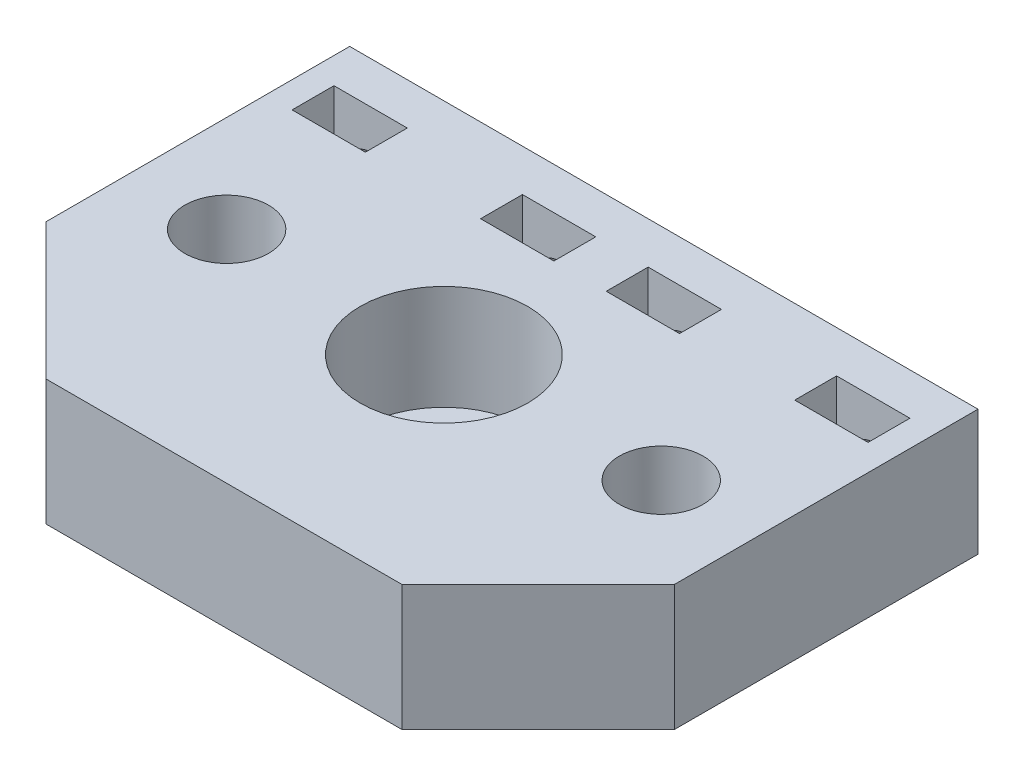
ISO-10303-21;
HEADER;
FILE_DESCRIPTION(('STEP AP214'),'2;1');
FILE_NAME('part.step','',(''),(''),'','','');
FILE_SCHEMA(('AUTOMOTIVE_DESIGN { 1 0 10303 214 1 1 1 1 }'));
ENDSEC;
DATA;
#1=APPLICATION_CONTEXT('core data for automotive mechanical design processes');
#2=APPLICATION_PROTOCOL_DEFINITION('international standard','automotive_design',2000,#1);
#3=PRODUCT_CONTEXT('',#1,'mechanical');
#4=PRODUCT('Part','Part','',(#3));
#5=PRODUCT_RELATED_PRODUCT_CATEGORY('part','',(#4));
#6=PRODUCT_DEFINITION_FORMATION('','',#4);
#7=PRODUCT_DEFINITION_CONTEXT('part definition',#1,'design');
#8=PRODUCT_DEFINITION('design','',#6,#7);
#9=PRODUCT_DEFINITION_SHAPE('','',#8);
#10=(LENGTH_UNIT() NAMED_UNIT(*) SI_UNIT(.MILLI.,.METRE.));
#11=(NAMED_UNIT(*) PLANE_ANGLE_UNIT() SI_UNIT($,.RADIAN.));
#12=(NAMED_UNIT(*) SI_UNIT($,.STERADIAN.) SOLID_ANGLE_UNIT());
#13=UNCERTAINTY_MEASURE_WITH_UNIT(LENGTH_MEASURE(1.E-05),#10,'distance_accuracy_value','');
#14=(GEOMETRIC_REPRESENTATION_CONTEXT(3) GLOBAL_UNCERTAINTY_ASSIGNED_CONTEXT((#13)) GLOBAL_UNIT_ASSIGNED_CONTEXT((#10,
#11,#12)) REPRESENTATION_CONTEXT('',''));
#15=CARTESIAN_POINT('',(0.,0.,0.));
#16=DIRECTION('',(0.,0.,1.));
#17=DIRECTION('',(1.,0.,0.));
#18=AXIS2_PLACEMENT_3D('',#15,#16,#17);
#19=CARTESIAN_POINT('',(0.,12.,0.));
#20=DIRECTION('',(0.,-1.,0.));
#21=DIRECTION('',(0.,0.,-1.));
#22=AXIS2_PLACEMENT_3D('',#19,#20,#21);
#23=PLANE('',#22);
#24=DIRECTION('',(1.,0.,0.));
#25=VECTOR('',#24,1.);
#26=CARTESIAN_POINT('',(0.,12.,-12.9999999999999));
#27=LINE('',#26,#25);
#28=CARTESIAN_POINT('',(2.49999999999995,12.,-12.9999999999999));
#29=VERTEX_POINT('',#28);
#30=CARTESIAN_POINT('',(9.49999999999995,12.,-12.9999999999999));
#31=VERTEX_POINT('',#30);
#32=EDGE_CURVE('E304',#29,#31,#27,.T.);
#33=ORIENTED_EDGE('',*,*,#32,.F.);
#34=DIRECTION('',(0.,0.,1.));
#35=VECTOR('',#34,1.);
#36=CARTESIAN_POINT('',(2.49999999999996,12.,0.));
#37=LINE('',#36,#35);
#38=CARTESIAN_POINT('',(2.49999999999994,12.,-17.));
#39=VERTEX_POINT('',#38);
#40=EDGE_CURVE('E298',#39,#29,#37,.T.);
#41=ORIENTED_EDGE('',*,*,#40,.F.);
#42=DIRECTION('',(-1.,0.,0.));
#43=VECTOR('',#42,1.);
#44=CARTESIAN_POINT('',(2.94902990916058E-13,12.,-17.));
#45=LINE('',#44,#43);
#46=CARTESIAN_POINT('',(9.49999999999994,12.,-16.9999999999999));
#47=VERTEX_POINT('',#46);
#48=EDGE_CURVE('E300',#47,#39,#45,.T.);
#49=ORIENTED_EDGE('',*,*,#48,.F.);
#50=DIRECTION('',(0.,0.,-1.));
#51=VECTOR('',#50,1.);
#52=CARTESIAN_POINT('',(9.49999999999997,12.,0.));
#53=LINE('',#52,#51);
#54=EDGE_CURVE('E302',#31,#47,#53,.T.);
#55=ORIENTED_EDGE('',*,*,#54,.F.);
#56=EDGE_LOOP('',(#33,#41,#49,#55));
#57=FACE_BOUND('',#56,.T.);
#58=DIRECTION('',(0.,0.,1.));
#59=VECTOR('',#58,1.);
#60=CARTESIAN_POINT('',(-27.5,12.,0.));
#61=LINE('',#60,#59);
#62=CARTESIAN_POINT('',(-27.4999999999999,12.,-17.));
#63=VERTEX_POINT('',#62);
#64=CARTESIAN_POINT('',(-27.4999999999999,12.,-13.));
#65=VERTEX_POINT('',#64);
#66=EDGE_CURVE('E287',#63,#65,#61,.T.);
#67=ORIENTED_EDGE('',*,*,#66,.F.);
#68=DIRECTION('',(-1.,0.,0.));
#69=VECTOR('',#68,1.);
#70=CARTESIAN_POINT('',(-3.03328790656524E-13,12.,-17.0000000000005));
#71=LINE('',#70,#69);
#72=CARTESIAN_POINT('',(-20.4999999999999,12.,-17.0000000000001));
#73=VERTEX_POINT('',#72);
#74=EDGE_CURVE('E196',#73,#63,#71,.T.);
#75=ORIENTED_EDGE('',*,*,#74,.F.);
#76=DIRECTION('',(0.,0.,-1.));
#77=VECTOR('',#76,1.);
#78=CARTESIAN_POINT('',(-20.5,12.,0.));
#79=LINE('',#78,#77);
#80=CARTESIAN_POINT('',(-20.4999999999999,12.,-13.));
#81=VERTEX_POINT('',#80);
#82=EDGE_CURVE('E282',#81,#73,#79,.T.);
#83=ORIENTED_EDGE('',*,*,#82,.F.);
#84=DIRECTION('',(1.,0.,0.));
#85=VECTOR('',#84,1.);
#86=CARTESIAN_POINT('',(0.,12.,-13.));
#87=LINE('',#86,#85);
#88=EDGE_CURVE('E285',#65,#81,#87,.T.);
#89=ORIENTED_EDGE('',*,*,#88,.F.);
#90=EDGE_LOOP('',(#67,#75,#83,#89));
#91=FACE_BOUND('',#90,.T.);
#92=CARTESIAN_POINT('',(-20.75,12.,0.));
#93=DIRECTION('',(0.,-1.,0.));
#94=DIRECTION('',(0.,0.,-1.));
#95=AXIS2_PLACEMENT_3D('',#92,#93,#94);
#96=CIRCLE('',#95,4.);
#97=CARTESIAN_POINT('',(-20.75,12.,-4.00000000000001));
#98=VERTEX_POINT('',#97);
#99=EDGE_CURVE('E327',#98,#98,#96,.F.);
#100=ORIENTED_EDGE('',*,*,#99,.F.);
#101=EDGE_LOOP('',(#100));
#102=FACE_BOUND('',#101,.T.);
#103=CARTESIAN_POINT('',(20.75,12.,0.));
#104=DIRECTION('',(0.,-1.,0.));
#105=DIRECTION('',(0.,0.,-1.));
#106=AXIS2_PLACEMENT_3D('',#103,#104,#105);
#107=CIRCLE('',#106,4.);
#108=CARTESIAN_POINT('',(20.75,12.,-4.));
#109=VERTEX_POINT('',#108);
#110=EDGE_CURVE('E359',#109,#109,#107,.F.);
#111=ORIENTED_EDGE('',*,*,#110,.F.);
#112=EDGE_LOOP('',(#111));
#113=FACE_BOUND('',#112,.T.);
#114=CARTESIAN_POINT('',(0.,12.,0.));
#115=DIRECTION('',(0.,-1.,0.));
#116=DIRECTION('',(0.,0.,-1.));
#117=AXIS2_PLACEMENT_3D('',#114,#115,#116);
#118=CIRCLE('',#117,8.);
#119=CARTESIAN_POINT('',(0.,12.,-8.));
#120=VERTEX_POINT('',#119);
#121=EDGE_CURVE('E356',#120,#120,#118,.F.);
#122=ORIENTED_EDGE('',*,*,#121,.F.);
#123=EDGE_LOOP('',(#122));
#124=FACE_BOUND('',#123,.T.);
#125=DIRECTION('',(1.,0.,0.));
#126=VECTOR('',#125,1.);
#127=CARTESIAN_POINT('',(-30.,12.,21.));
#128=LINE('',#127,#126);
#129=CARTESIAN_POINT('',(-17.,12.,21.));
#130=VERTEX_POINT('',#129);
#131=CARTESIAN_POINT('',(17.,12.,21.));
#132=VERTEX_POINT('',#131);
#133=EDGE_CURVE('E336',#130,#132,#128,.T.);
#134=ORIENTED_EDGE('',*,*,#133,.T.);
#135=DIRECTION('',(-0.707106781186549,0.,0.707106781186546));
#136=VECTOR('',#135,1.);
#137=CARTESIAN_POINT('',(30.,12.,8.00000000000002));
#138=LINE('',#137,#136);
#139=CARTESIAN_POINT('',(30.,12.,8.00000000000002));
#140=VERTEX_POINT('',#139);
#141=EDGE_CURVE('E45',#132,#140,#138,.F.);
#142=ORIENTED_EDGE('',*,*,#141,.T.);
#143=DIRECTION('',(0.,0.,-1.));
#144=VECTOR('',#143,1.);
#145=CARTESIAN_POINT('',(30.,12.,21.));
#146=LINE('',#145,#144);
#147=CARTESIAN_POINT('',(30.,12.,-21.));
#148=VERTEX_POINT('',#147);
#149=EDGE_CURVE('E328',#140,#148,#146,.T.);
#150=ORIENTED_EDGE('',*,*,#149,.T.);
#151=DIRECTION('',(-1.,0.,0.));
#152=VECTOR('',#151,1.);
#153=CARTESIAN_POINT('',(-30.,12.,-21.));
#154=LINE('',#153,#152);
#155=CARTESIAN_POINT('',(-30.,12.,-21.));
#156=VERTEX_POINT('',#155);
#157=EDGE_CURVE('E330',#148,#156,#154,.T.);
#158=ORIENTED_EDGE('',*,*,#157,.T.);
#159=DIRECTION('',(0.,0.,1.));
#160=VECTOR('',#159,1.);
#161=CARTESIAN_POINT('',(-30.,12.,21.));
#162=LINE('',#161,#160);
#163=CARTESIAN_POINT('',(-30.,12.,7.99999999999996));
#164=VERTEX_POINT('',#163);
#165=EDGE_CURVE('E333',#156,#164,#162,.T.);
#166=ORIENTED_EDGE('',*,*,#165,.T.);
#167=DIRECTION('',(-0.707106781186546,0.,-0.707106781186549));
#168=VECTOR('',#167,1.);
#169=CARTESIAN_POINT('',(-17.,12.,21.));
#170=LINE('',#169,#168);
#171=EDGE_CURVE('E375',#164,#130,#170,.F.);
#172=ORIENTED_EDGE('',*,*,#171,.T.);
#173=EDGE_LOOP('',(#134,#142,#150,#158,#166,#172));
#174=FACE_BOUND('',#173,.T.);
#175=DIRECTION('',(0.,0.,1.));
#176=VECTOR('',#175,1.);
#177=CARTESIAN_POINT('',(-9.49999999999995,12.,0.));
#178=LINE('',#177,#176);
#179=CARTESIAN_POINT('',(-9.49999999999994,12.,-16.9999999999999));
#180=VERTEX_POINT('',#179);
#181=CARTESIAN_POINT('',(-9.49999999999994,12.,-12.9999999999999));
#182=VERTEX_POINT('',#181);
#183=EDGE_CURVE('E296',#180,#182,#178,.T.);
#184=ORIENTED_EDGE('',*,*,#183,.F.);
#185=DIRECTION('',(-1.,0.,0.));
#186=VECTOR('',#185,1.);
#187=CARTESIAN_POINT('',(-3.03328790656517E-13,12.,-17.));
#188=LINE('',#187,#186);
#189=CARTESIAN_POINT('',(-2.49999999999994,12.,-17.));
#190=VERTEX_POINT('',#189);
#191=EDGE_CURVE('E289',#190,#180,#188,.T.);
#192=ORIENTED_EDGE('',*,*,#191,.F.);
#193=DIRECTION('',(0.,0.,-1.));
#194=VECTOR('',#193,1.);
#195=CARTESIAN_POINT('',(-2.49999999999995,12.,0.));
#196=LINE('',#195,#194);
#197=CARTESIAN_POINT('',(-2.49999999999994,12.,-12.9999999999999));
#198=VERTEX_POINT('',#197);
#199=EDGE_CURVE('E291',#198,#190,#196,.T.);
#200=ORIENTED_EDGE('',*,*,#199,.F.);
#201=DIRECTION('',(1.,0.,0.));
#202=VECTOR('',#201,1.);
#203=CARTESIAN_POINT('',(0.,12.,-12.9999999999999));
#204=LINE('',#203,#202);
#205=EDGE_CURVE('E294',#182,#198,#204,.T.);
#206=ORIENTED_EDGE('',*,*,#205,.F.);
#207=EDGE_LOOP('',(#184,#192,#200,#206));
#208=FACE_BOUND('',#207,.T.);
#209=DIRECTION('',(0.,0.,1.));
#210=VECTOR('',#209,1.);
#211=CARTESIAN_POINT('',(20.5,12.,0.));
#212=LINE('',#211,#210);
#213=CARTESIAN_POINT('',(20.4999999999999,12.,-17.0000000000001));
#214=VERTEX_POINT('',#213);
#215=CARTESIAN_POINT('',(20.4999999999999,12.,-13.));
#216=VERTEX_POINT('',#215);
#217=EDGE_CURVE('E193',#214,#216,#212,.T.);
#218=ORIENTED_EDGE('',*,*,#217,.F.);
#219=DIRECTION('',(-1.,0.,0.));
#220=VECTOR('',#219,1.);
#221=CARTESIAN_POINT('',(2.94902990916065E-13,12.,-17.0000000000005));
#222=LINE('',#221,#220);
#223=CARTESIAN_POINT('',(27.4999999999999,12.,-17.));
#224=VERTEX_POINT('',#223);
#225=EDGE_CURVE('E306',#224,#214,#222,.T.);
#226=ORIENTED_EDGE('',*,*,#225,.F.);
#227=DIRECTION('',(0.,0.,-1.));
#228=VECTOR('',#227,1.);
#229=CARTESIAN_POINT('',(27.5,12.,0.));
#230=LINE('',#229,#228);
#231=CARTESIAN_POINT('',(27.4999999999999,12.,-13.));
#232=VERTEX_POINT('',#231);
#233=EDGE_CURVE('E308',#232,#224,#230,.T.);
#234=ORIENTED_EDGE('',*,*,#233,.F.);
#235=DIRECTION('',(1.,0.,0.));
#236=VECTOR('',#235,1.);
#237=CARTESIAN_POINT('',(0.,12.,-13.));
#238=LINE('',#237,#236);
#239=EDGE_CURVE('E310',#216,#232,#238,.T.);
#240=ORIENTED_EDGE('',*,*,#239,.F.);
#241=EDGE_LOOP('',(#218,#226,#234,#240));
#242=FACE_BOUND('',#241,.T.);
#243=ADVANCED_FACE('F35',(#57,#91,#102,#113,#124,#174,#208,#242),#23,.F.);
#244=CARTESIAN_POINT('',(0.,0.,0.));
#245=DIRECTION('',(0.,-1.,0.));
#246=DIRECTION('',(0.,0.,-1.));
#247=AXIS2_PLACEMENT_3D('',#244,#245,#246);
#248=PLANE('',#247);
#249=CARTESIAN_POINT('',(0.,0.,0.));
#250=DIRECTION('',(0.,-1.,0.));
#251=DIRECTION('',(0.,0.,-1.));
#252=AXIS2_PLACEMENT_3D('',#249,#250,#251);
#253=CIRCLE('',#252,4.);
#254=CARTESIAN_POINT('',(0.,0.,-4.));
#255=VERTEX_POINT('',#254);
#256=EDGE_CURVE('E323',#255,#255,#253,.F.);
#257=ORIENTED_EDGE('',*,*,#256,.T.);
#258=EDGE_LOOP('',(#257));
#259=FACE_BOUND('',#258,.T.);
#260=DIRECTION('',(0.,0.,-1.));
#261=VECTOR('',#260,1.);
#262=CARTESIAN_POINT('',(30.,0.,21.));
#263=LINE('',#262,#261);
#264=CARTESIAN_POINT('',(30.,0.,8.00000000000002));
#265=VERTEX_POINT('',#264);
#266=CARTESIAN_POINT('',(30.,0.,-21.));
#267=VERTEX_POINT('',#266);
#268=EDGE_CURVE('E326',#265,#267,#263,.T.);
#269=ORIENTED_EDGE('',*,*,#268,.F.);
#270=DIRECTION('',(0.707106781186549,0.,-0.707106781186546));
#271=VECTOR('',#270,1.);
#272=CARTESIAN_POINT('',(18.9999999999999,0.,19.));
#273=LINE('',#272,#271);
#274=CARTESIAN_POINT('',(17.,0.,21.));
#275=VERTEX_POINT('',#274);
#276=EDGE_CURVE('E368',#265,#275,#273,.F.);
#277=ORIENTED_EDGE('',*,*,#276,.T.);
#278=DIRECTION('',(1.,0.,0.));
#279=VECTOR('',#278,1.);
#280=CARTESIAN_POINT('',(-30.,0.,21.));
#281=LINE('',#280,#279);
#282=CARTESIAN_POINT('',(-17.,0.,21.));
#283=VERTEX_POINT('',#282);
#284=EDGE_CURVE('E331',#283,#275,#281,.T.);
#285=ORIENTED_EDGE('',*,*,#284,.F.);
#286=DIRECTION('',(0.707106781186546,0.,0.707106781186549));
#287=VECTOR('',#286,1.);
#288=CARTESIAN_POINT('',(-19.,0.,19.));
#289=LINE('',#288,#287);
#290=CARTESIAN_POINT('',(-30.,0.,7.99999999999996));
#291=VERTEX_POINT('',#290);
#292=EDGE_CURVE('E366',#283,#291,#289,.F.);
#293=ORIENTED_EDGE('',*,*,#292,.T.);
#294=DIRECTION('',(0.,0.,1.));
#295=VECTOR('',#294,1.);
#296=CARTESIAN_POINT('',(-30.,0.,21.));
#297=LINE('',#296,#295);
#298=CARTESIAN_POINT('',(-30.,0.,-21.));
#299=VERTEX_POINT('',#298);
#300=EDGE_CURVE('E343',#299,#291,#297,.T.);
#301=ORIENTED_EDGE('',*,*,#300,.F.);
#302=DIRECTION('',(-1.,0.,0.));
#303=VECTOR('',#302,1.);
#304=CARTESIAN_POINT('',(-30.,0.,-21.));
#305=LINE('',#304,#303);
#306=EDGE_CURVE('E341',#267,#299,#305,.T.);
#307=ORIENTED_EDGE('',*,*,#306,.F.);
#308=EDGE_LOOP('',(#269,#277,#285,#293,#301,#307));
#309=FACE_BOUND('',#308,.T.);
#310=DIRECTION('',(-1.,0.,0.));
#311=VECTOR('',#310,1.);
#312=CARTESIAN_POINT('',(-27.4999999999999,0.,-17.));
#313=LINE('',#312,#311);
#314=CARTESIAN_POINT('',(-20.4999999999999,0.,-17.0000000000001));
#315=VERTEX_POINT('',#314);
#316=CARTESIAN_POINT('',(-27.4999999999999,0.,-17.));
#317=VERTEX_POINT('',#316);
#318=EDGE_CURVE('E264',#315,#317,#313,.T.);
#319=ORIENTED_EDGE('',*,*,#318,.T.);
#320=DIRECTION('',(0.,0.,1.));
#321=VECTOR('',#320,1.);
#322=CARTESIAN_POINT('',(-27.4999999999999,0.,-17.));
#323=LINE('',#322,#321);
#324=CARTESIAN_POINT('',(-27.4999999999999,0.,-13.));
#325=VERTEX_POINT('',#324);
#326=EDGE_CURVE('E267',#317,#325,#323,.T.);
#327=ORIENTED_EDGE('',*,*,#326,.T.);
#328=DIRECTION('',(1.,0.,0.));
#329=VECTOR('',#328,1.);
#330=CARTESIAN_POINT('',(-27.4999999999999,0.,-13.));
#331=LINE('',#330,#329);
#332=CARTESIAN_POINT('',(-20.4999999999999,0.,-13.));
#333=VERTEX_POINT('',#332);
#334=EDGE_CURVE('E270',#325,#333,#331,.T.);
#335=ORIENTED_EDGE('',*,*,#334,.T.);
#336=DIRECTION('',(0.,0.,-1.));
#337=VECTOR('',#336,1.);
#338=CARTESIAN_POINT('',(-20.4999999999999,0.,-17.0000000000001));
#339=LINE('',#338,#337);
#340=EDGE_CURVE('E261',#333,#315,#339,.T.);
#341=ORIENTED_EDGE('',*,*,#340,.T.);
#342=EDGE_LOOP('',(#319,#327,#335,#341));
#343=FACE_BOUND('',#342,.T.);
#344=DIRECTION('',(-1.,0.,0.));
#345=VECTOR('',#344,1.);
#346=CARTESIAN_POINT('',(-9.49999999999994,0.,-16.9999999999999));
#347=LINE('',#346,#345);
#348=CARTESIAN_POINT('',(-2.49999999999994,0.,-17.));
#349=VERTEX_POINT('',#348);
#350=CARTESIAN_POINT('',(-9.49999999999994,0.,-16.9999999999999));
#351=VERTEX_POINT('',#350);
#352=EDGE_CURVE('E243',#349,#351,#347,.T.);
#353=ORIENTED_EDGE('',*,*,#352,.T.);
#354=DIRECTION('',(0.,0.,1.));
#355=VECTOR('',#354,1.);
#356=CARTESIAN_POINT('',(-9.49999999999994,0.,-16.9999999999999));
#357=LINE('',#356,#355);
#358=CARTESIAN_POINT('',(-9.49999999999994,0.,-12.9999999999999));
#359=VERTEX_POINT('',#358);
#360=EDGE_CURVE('E247',#351,#359,#357,.T.);
#361=ORIENTED_EDGE('',*,*,#360,.T.);
#362=DIRECTION('',(1.,0.,0.));
#363=VECTOR('',#362,1.);
#364=CARTESIAN_POINT('',(-9.49999999999994,0.,-12.9999999999999));
#365=LINE('',#364,#363);
#366=CARTESIAN_POINT('',(-2.49999999999994,0.,-12.9999999999999));
#367=VERTEX_POINT('',#366);
#368=EDGE_CURVE('E250',#359,#367,#365,.T.);
#369=ORIENTED_EDGE('',*,*,#368,.T.);
#370=DIRECTION('',(0.,0.,-1.));
#371=VECTOR('',#370,1.);
#372=CARTESIAN_POINT('',(-2.49999999999994,0.,-17.));
#373=LINE('',#372,#371);
#374=EDGE_CURVE('E240',#367,#349,#373,.T.);
#375=ORIENTED_EDGE('',*,*,#374,.T.);
#376=EDGE_LOOP('',(#353,#361,#369,#375));
#377=FACE_BOUND('',#376,.T.);
#378=DIRECTION('',(0.,0.,1.));
#379=VECTOR('',#378,1.);
#380=CARTESIAN_POINT('',(2.49999999999994,0.,-17.));
#381=LINE('',#380,#379);
#382=CARTESIAN_POINT('',(2.49999999999994,0.,-17.));
#383=VERTEX_POINT('',#382);
#384=CARTESIAN_POINT('',(2.49999999999995,0.,-12.9999999999999));
#385=VERTEX_POINT('',#384);
#386=EDGE_CURVE('E222',#383,#385,#381,.T.);
#387=ORIENTED_EDGE('',*,*,#386,.T.);
#388=DIRECTION('',(1.,0.,0.));
#389=VECTOR('',#388,1.);
#390=CARTESIAN_POINT('',(9.49999999999995,0.,-12.9999999999999));
#391=LINE('',#390,#389);
#392=CARTESIAN_POINT('',(9.49999999999995,0.,-12.9999999999999));
#393=VERTEX_POINT('',#392);
#394=EDGE_CURVE('E226',#385,#393,#391,.T.);
#395=ORIENTED_EDGE('',*,*,#394,.T.);
#396=DIRECTION('',(0.,0.,-1.));
#397=VECTOR('',#396,1.);
#398=CARTESIAN_POINT('',(9.49999999999994,0.,-16.9999999999999));
#399=LINE('',#398,#397);
#400=CARTESIAN_POINT('',(9.49999999999994,0.,-16.9999999999999));
#401=VERTEX_POINT('',#400);
#402=EDGE_CURVE('E229',#393,#401,#399,.T.);
#403=ORIENTED_EDGE('',*,*,#402,.T.);
#404=DIRECTION('',(-1.,0.,0.));
#405=VECTOR('',#404,1.);
#406=CARTESIAN_POINT('',(9.49999999999994,0.,-16.9999999999999));
#407=LINE('',#406,#405);
#408=EDGE_CURVE('E219',#401,#383,#407,.T.);
#409=ORIENTED_EDGE('',*,*,#408,.T.);
#410=EDGE_LOOP('',(#387,#395,#403,#409));
#411=FACE_BOUND('',#410,.T.);
#412=DIRECTION('',(-1.,0.,0.));
#413=VECTOR('',#412,1.);
#414=CARTESIAN_POINT('',(27.4999999999999,0.,-17.));
#415=LINE('',#414,#413);
#416=CARTESIAN_POINT('',(27.4999999999999,0.,-17.));
#417=VERTEX_POINT('',#416);
#418=CARTESIAN_POINT('',(20.4999999999999,0.,-17.0000000000001));
#419=VERTEX_POINT('',#418);
#420=EDGE_CURVE('E210',#417,#419,#415,.T.);
#421=ORIENTED_EDGE('',*,*,#420,.T.);
#422=DIRECTION('',(0.,0.,1.));
#423=VECTOR('',#422,1.);
#424=CARTESIAN_POINT('',(20.4999999999999,0.,-17.0000000000001));
#425=LINE('',#424,#423);
#426=CARTESIAN_POINT('',(20.4999999999999,0.,-13.));
#427=VERTEX_POINT('',#426);
#428=EDGE_CURVE('E190',#419,#427,#425,.T.);
#429=ORIENTED_EDGE('',*,*,#428,.T.);
#430=DIRECTION('',(1.,0.,0.));
#431=VECTOR('',#430,1.);
#432=CARTESIAN_POINT('',(27.4999999999999,0.,-13.));
#433=LINE('',#432,#431);
#434=CARTESIAN_POINT('',(27.4999999999999,0.,-13.));
#435=VERTEX_POINT('',#434);
#436=EDGE_CURVE('E200',#427,#435,#433,.T.);
#437=ORIENTED_EDGE('',*,*,#436,.T.);
#438=DIRECTION('',(0.,0.,-1.));
#439=VECTOR('',#438,1.);
#440=CARTESIAN_POINT('',(27.4999999999999,0.,-17.));
#441=LINE('',#440,#439);
#442=EDGE_CURVE('E212',#435,#417,#441,.T.);
#443=ORIENTED_EDGE('',*,*,#442,.T.);
#444=EDGE_LOOP('',(#421,#429,#437,#443));
#445=FACE_BOUND('',#444,.T.);
#446=ADVANCED_FACE('F209',(#259,#309,#343,#377,#411,#445),#248,.T.);
#447=CARTESIAN_POINT('',(0.,12.000012,0.));
#448=DIRECTION('',(0.,-1.,0.));
#449=DIRECTION('',(0.,0.,-1.));
#450=AXIS2_PLACEMENT_3D('',#447,#448,#449);
#451=CYLINDRICAL_SURFACE('',#450,4.);
#452=ORIENTED_EDGE('',*,*,#256,.F.);
#453=EDGE_LOOP('',(#452));
#454=FACE_BOUND('',#453,.T.);
#455=CARTESIAN_POINT('',(0.,2.,0.));
#456=DIRECTION('',(0.,1.,0.));
#457=DIRECTION('',(0.,0.,1.));
#458=AXIS2_PLACEMENT_3D('',#455,#456,#457);
#459=CIRCLE('',#458,4.);
#460=CARTESIAN_POINT('',(0.,2.,4.));
#461=VERTEX_POINT('',#460);
#462=EDGE_CURVE('E322',#461,#461,#459,.T.);
#463=ORIENTED_EDGE('',*,*,#462,.T.);
#464=EDGE_LOOP('',(#463));
#465=FACE_BOUND('',#464,.T.);
#466=ADVANCED_FACE('F420',(#454,#465),#451,.F.);
#467=CARTESIAN_POINT('',(30.,12.,21.));
#468=DIRECTION('',(-1.,0.,0.));
#469=DIRECTION('',(0.,0.,1.));
#470=AXIS2_PLACEMENT_3D('',#467,#468,#469);
#471=PLANE('',#470);
#472=ORIENTED_EDGE('',*,*,#149,.F.);
#473=DIRECTION('',(0.,-1.,0.));
#474=VECTOR('',#473,1.);
#475=CARTESIAN_POINT('',(30.,12.,8.00000000000002));
#476=LINE('',#475,#474);
#477=EDGE_CURVE('E353',#140,#265,#476,.T.);
#478=ORIENTED_EDGE('',*,*,#477,.T.);
#479=ORIENTED_EDGE('',*,*,#268,.T.);
#480=DIRECTION('',(0.,-1.,0.));
#481=VECTOR('',#480,1.);
#482=CARTESIAN_POINT('',(30.,12.,-21.));
#483=LINE('',#482,#481);
#484=EDGE_CURVE('E350',#148,#267,#483,.T.);
#485=ORIENTED_EDGE('',*,*,#484,.F.);
#486=EDGE_LOOP('',(#472,#478,#479,#485));
#487=FACE_BOUND('',#486,.T.);
#488=ADVANCED_FACE('F471',(#487),#471,.F.);
#489=CARTESIAN_POINT('',(-30.,12.,-21.));
#490=DIRECTION('',(0.,0.,1.));
#491=DIRECTION('',(1.,0.,0.));
#492=AXIS2_PLACEMENT_3D('',#489,#490,#491);
#493=PLANE('',#492);
#494=CARTESIAN_POINT('',(24.,6.,-21.));
#495=DIRECTION('',(0.,0.,-1.));
#496=DIRECTION('',(-1.,0.,0.));
#497=AXIS2_PLACEMENT_3D('',#494,#495,#496);
#498=CIRCLE('',#497,2.25);
#499=CARTESIAN_POINT('',(21.75,6.,-21.));
#500=VERTEX_POINT('',#499);
#501=EDGE_CURVE('E382',#500,#500,#498,.T.);
#502=ORIENTED_EDGE('',*,*,#501,.F.);
#503=EDGE_LOOP('',(#502));
#504=FACE_BOUND('',#503,.T.);
#505=CARTESIAN_POINT('',(-6.,6.,-21.));
#506=DIRECTION('',(0.,0.,-1.));
#507=DIRECTION('',(1.,0.,0.));
#508=AXIS2_PLACEMENT_3D('',#505,#506,#507);
#509=CIRCLE('',#508,2.25);
#510=CARTESIAN_POINT('',(-3.75,6.,-21.));
#511=VERTEX_POINT('',#510);
#512=EDGE_CURVE('E525',#511,#511,#509,.T.);
#513=ORIENTED_EDGE('',*,*,#512,.F.);
#514=EDGE_LOOP('',(#513));
#515=FACE_BOUND('',#514,.T.);
#516=CARTESIAN_POINT('',(6.,6.,-21.));
#517=DIRECTION('',(0.,0.,-1.));
#518=DIRECTION('',(-1.,0.,0.));
#519=AXIS2_PLACEMENT_3D('',#516,#517,#518);
#520=CIRCLE('',#519,2.25);
#521=CARTESIAN_POINT('',(3.75,6.,-21.));
#522=VERTEX_POINT('',#521);
#523=EDGE_CURVE('E522',#522,#522,#520,.T.);
#524=ORIENTED_EDGE('',*,*,#523,.F.);
#525=EDGE_LOOP('',(#524));
#526=FACE_BOUND('',#525,.T.);
#527=CARTESIAN_POINT('',(-24.,6.00000000000001,-21.));
#528=DIRECTION('',(0.,0.,-1.));
#529=DIRECTION('',(1.,0.,0.));
#530=AXIS2_PLACEMENT_3D('',#527,#528,#529);
#531=CIRCLE('',#530,2.25);
#532=CARTESIAN_POINT('',(-21.75,6.00000000000001,-21.));
#533=VERTEX_POINT('',#532);
#534=EDGE_CURVE('E519',#533,#533,#531,.T.);
#535=ORIENTED_EDGE('',*,*,#534,.F.);
#536=EDGE_LOOP('',(#535));
#537=FACE_BOUND('',#536,.T.);
#538=ORIENTED_EDGE('',*,*,#306,.T.);
#539=DIRECTION('',(0.,-1.,0.));
#540=VECTOR('',#539,1.);
#541=CARTESIAN_POINT('',(-30.,12.,-21.));
#542=LINE('',#541,#540);
#543=EDGE_CURVE('E339',#156,#299,#542,.T.);
#544=ORIENTED_EDGE('',*,*,#543,.F.);
#545=ORIENTED_EDGE('',*,*,#157,.F.);
#546=ORIENTED_EDGE('',*,*,#484,.T.);
#547=EDGE_LOOP('',(#538,#544,#545,#546));
#548=FACE_BOUND('',#547,.T.);
#549=ADVANCED_FACE('F467',(#504,#515,#526,#537,#548),#493,.F.);
#550=CARTESIAN_POINT('',(-30.,12.,21.));
#551=DIRECTION('',(1.,0.,0.));
#552=DIRECTION('',(0.,0.,-1.));
#553=AXIS2_PLACEMENT_3D('',#550,#551,#552);
#554=PLANE('',#553);
#555=ORIENTED_EDGE('',*,*,#300,.T.);
#556=DIRECTION('',(0.,1.,0.));
#557=VECTOR('',#556,1.);
#558=CARTESIAN_POINT('',(-30.,12.,7.99999999999995));
#559=LINE('',#558,#557);
#560=EDGE_CURVE('E11',#291,#164,#559,.T.);
#561=ORIENTED_EDGE('',*,*,#560,.T.);
#562=ORIENTED_EDGE('',*,*,#165,.F.);
#563=ORIENTED_EDGE('',*,*,#543,.T.);
#564=EDGE_LOOP('',(#555,#561,#562,#563));
#565=FACE_BOUND('',#564,.T.);
#566=ADVANCED_FACE('F463',(#565),#554,.F.);
#567=CARTESIAN_POINT('',(-30.,12.,21.));
#568=DIRECTION('',(0.,0.,-1.));
#569=DIRECTION('',(-1.,0.,0.));
#570=AXIS2_PLACEMENT_3D('',#567,#568,#569);
#571=PLANE('',#570);
#572=ORIENTED_EDGE('',*,*,#284,.T.);
#573=DIRECTION('',(0.,1.,0.));
#574=VECTOR('',#573,1.);
#575=CARTESIAN_POINT('',(17.,12.,21.));
#576=LINE('',#575,#574);
#577=EDGE_CURVE('E373',#275,#132,#576,.T.);
#578=ORIENTED_EDGE('',*,*,#577,.T.);
#579=ORIENTED_EDGE('',*,*,#133,.F.);
#580=DIRECTION('',(0.,-1.,0.));
#581=VECTOR('',#580,1.);
#582=CARTESIAN_POINT('',(-17.,12.,21.));
#583=LINE('',#582,#581);
#584=EDGE_CURVE('E370',#130,#283,#583,.T.);
#585=ORIENTED_EDGE('',*,*,#584,.T.);
#586=EDGE_LOOP('',(#572,#578,#579,#585));
#587=FACE_BOUND('',#586,.T.);
#588=ADVANCED_FACE('F459',(#587),#571,.F.);
#589=CARTESIAN_POINT('',(0.,12.000012,0.));
#590=DIRECTION('',(0.,-1.,0.));
#591=DIRECTION('',(0.,0.,-1.));
#592=AXIS2_PLACEMENT_3D('',#589,#590,#591);
#593=CYLINDRICAL_SURFACE('',#592,8.);
#594=CARTESIAN_POINT('',(0.,2.,0.));
#595=DIRECTION('',(0.,1.,0.));
#596=DIRECTION('',(0.,0.,1.));
#597=AXIS2_PLACEMENT_3D('',#594,#595,#596);
#598=CIRCLE('',#597,8.);
#599=CARTESIAN_POINT('',(0.,2.,8.));
#600=VERTEX_POINT('',#599);
#601=EDGE_CURVE('E317',#600,#600,#598,.T.);
#602=ORIENTED_EDGE('',*,*,#601,.F.);
#603=EDGE_LOOP('',(#602));
#604=FACE_BOUND('',#603,.T.);
#605=ORIENTED_EDGE('',*,*,#121,.T.);
#606=EDGE_LOOP('',(#605));
#607=FACE_BOUND('',#606,.T.);
#608=ADVANCED_FACE('F462',(#604,#607),#593,.F.);
#609=CARTESIAN_POINT('',(0.,2.,0.));
#610=DIRECTION('',(0.,1.,0.));
#611=DIRECTION('',(0.,0.,1.));
#612=AXIS2_PLACEMENT_3D('',#609,#610,#611);
#613=PLANE('',#612);
#614=ORIENTED_EDGE('',*,*,#462,.F.);
#615=EDGE_LOOP('',(#614));
#616=FACE_BOUND('',#615,.T.);
#617=ORIENTED_EDGE('',*,*,#601,.T.);
#618=EDGE_LOOP('',(#617));
#619=FACE_BOUND('',#618,.T.);
#620=ADVANCED_FACE('F741',(#616,#619),#613,.T.);
#621=CARTESIAN_POINT('',(20.75,12.000012,0.));
#622=DIRECTION('',(0.,-1.,0.));
#623=DIRECTION('',(0.,0.,-1.));
#624=AXIS2_PLACEMENT_3D('',#621,#622,#623);
#625=CYLINDRICAL_SURFACE('',#624,4.);
#626=CARTESIAN_POINT('',(20.75,2.,0.));
#627=DIRECTION('',(0.,1.,0.));
#628=DIRECTION('',(0.,0.,1.));
#629=AXIS2_PLACEMENT_3D('',#626,#627,#628);
#630=CIRCLE('',#629,4.);
#631=CARTESIAN_POINT('',(20.75,2.,4.));
#632=VERTEX_POINT('',#631);
#633=EDGE_CURVE('E314',#632,#632,#630,.T.);
#634=ORIENTED_EDGE('',*,*,#633,.F.);
#635=EDGE_LOOP('',(#634));
#636=FACE_BOUND('',#635,.T.);
#637=ORIENTED_EDGE('',*,*,#110,.T.);
#638=EDGE_LOOP('',(#637));
#639=FACE_BOUND('',#638,.T.);
#640=ADVANCED_FACE('F732',(#636,#639),#625,.F.);
#641=CARTESIAN_POINT('',(20.75,2.,0.));
#642=DIRECTION('',(0.,1.,0.));
#643=DIRECTION('',(0.,0.,1.));
#644=AXIS2_PLACEMENT_3D('',#641,#642,#643);
#645=PLANE('',#644);
#646=ORIENTED_EDGE('',*,*,#633,.T.);
#647=EDGE_LOOP('',(#646));
#648=FACE_BOUND('',#647,.T.);
#649=ADVANCED_FACE('F723',(#648),#645,.T.);
#650=CARTESIAN_POINT('',(-20.75,12.000012,0.));
#651=DIRECTION('',(0.,-1.,0.));
#652=DIRECTION('',(0.,0.,-1.));
#653=AXIS2_PLACEMENT_3D('',#650,#651,#652);
#654=CYLINDRICAL_SURFACE('',#653,4.);
#655=CARTESIAN_POINT('',(-20.75,2.,0.));
#656=DIRECTION('',(0.,1.,0.));
#657=DIRECTION('',(0.,0.,-1.));
#658=AXIS2_PLACEMENT_3D('',#655,#656,#657);
#659=CIRCLE('',#658,4.);
#660=CARTESIAN_POINT('',(-20.75,2.,-4.00000000000001));
#661=VERTEX_POINT('',#660);
#662=EDGE_CURVE('E313',#661,#661,#659,.T.);
#663=ORIENTED_EDGE('',*,*,#662,.F.);
#664=EDGE_LOOP('',(#663));
#665=FACE_BOUND('',#664,.T.);
#666=ORIENTED_EDGE('',*,*,#99,.T.);
#667=EDGE_LOOP('',(#666));
#668=FACE_BOUND('',#667,.T.);
#669=ADVANCED_FACE('F487',(#665,#668),#654,.F.);
#670=CARTESIAN_POINT('',(-20.75,2.,0.));
#671=DIRECTION('',(0.,-1.,0.));
#672=DIRECTION('',(0.,0.,-1.));
#673=AXIS2_PLACEMENT_3D('',#670,#671,#672);
#674=PLANE('',#673);
#675=ORIENTED_EDGE('',*,*,#662,.T.);
#676=EDGE_LOOP('',(#675));
#677=FACE_BOUND('',#676,.T.);
#678=ADVANCED_FACE('F480',(#677),#674,.F.);
#679=CARTESIAN_POINT('',(30.,12.,8.00000000000002));
#680=DIRECTION('',(-0.707106781186546,0.,-0.707106781186549));
#681=DIRECTION('',(0.,-1.,0.));
#682=AXIS2_PLACEMENT_3D('',#679,#680,#681);
#683=PLANE('',#682);
#684=ORIENTED_EDGE('',*,*,#141,.F.);
#685=ORIENTED_EDGE('',*,*,#577,.F.);
#686=ORIENTED_EDGE('',*,*,#276,.F.);
#687=ORIENTED_EDGE('',*,*,#477,.F.);
#688=EDGE_LOOP('',(#684,#685,#686,#687));
#689=FACE_BOUND('',#688,.T.);
#690=ADVANCED_FACE('F476',(#689),#683,.F.);
#691=CARTESIAN_POINT('',(-17.,12.,21.));
#692=DIRECTION('',(0.707106781186549,0.,-0.707106781186546));
#693=DIRECTION('',(0.,-1.,0.));
#694=AXIS2_PLACEMENT_3D('',#691,#692,#693);
#695=PLANE('',#694);
#696=ORIENTED_EDGE('',*,*,#171,.F.);
#697=ORIENTED_EDGE('',*,*,#560,.F.);
#698=ORIENTED_EDGE('',*,*,#292,.F.);
#699=ORIENTED_EDGE('',*,*,#584,.F.);
#700=EDGE_LOOP('',(#696,#697,#698,#699));
#701=FACE_BOUND('',#700,.T.);
#702=ADVANCED_FACE('F38',(#701),#695,.F.);
#703=CARTESIAN_POINT('',(-27.4999999999999,12.000012,-17.));
#704=DIRECTION('',(1.,0.,0.));
#705=DIRECTION('',(0.,0.,-1.));
#706=AXIS2_PLACEMENT_3D('',#703,#704,#705);
#707=PLANE('',#706);
#708=ORIENTED_EDGE('',*,*,#66,.T.);
#709=DIRECTION('',(0.,-1.,0.));
#710=VECTOR('',#709,1.);
#711=CARTESIAN_POINT('',(-27.4999999999999,12.000012,-13.));
#712=LINE('',#711,#710);
#713=EDGE_CURVE('E244',#65,#325,#712,.T.);
#714=ORIENTED_EDGE('',*,*,#713,.T.);
#715=ORIENTED_EDGE('',*,*,#326,.F.);
#716=DIRECTION('',(0.,-1.,0.));
#717=VECTOR('',#716,1.);
#718=CARTESIAN_POINT('',(-27.4999999999999,12.000012,-17.));
#719=LINE('',#718,#717);
#720=EDGE_CURVE('E273',#63,#317,#719,.T.);
#721=ORIENTED_EDGE('',*,*,#720,.F.);
#722=EDGE_LOOP('',(#708,#714,#715,#721));
#723=FACE_BOUND('',#722,.T.);
#724=ADVANCED_FACE('F407',(#723),#707,.T.);
#725=CARTESIAN_POINT('',(-27.4999999999999,12.000012,-13.));
#726=DIRECTION('',(0.,0.,-1.));
#727=DIRECTION('',(-1.,0.,0.));
#728=AXIS2_PLACEMENT_3D('',#725,#726,#727);
#729=PLANE('',#728);
#730=ORIENTED_EDGE('',*,*,#88,.T.);
#731=DIRECTION('',(0.,-1.,0.));
#732=VECTOR('',#731,1.);
#733=CARTESIAN_POINT('',(-20.4999999999999,12.000012,-13.));
#734=LINE('',#733,#732);
#735=EDGE_CURVE('E278',#81,#333,#734,.T.);
#736=ORIENTED_EDGE('',*,*,#735,.T.);
#737=ORIENTED_EDGE('',*,*,#334,.F.);
#738=ORIENTED_EDGE('',*,*,#713,.F.);
#739=EDGE_LOOP('',(#730,#736,#737,#738));
#740=FACE_BOUND('',#739,.T.);
#741=ADVANCED_FACE('F413',(#740),#729,.T.);
#742=CARTESIAN_POINT('',(-20.4999999999999,12.000012,-17.0000000000001));
#743=DIRECTION('',(-1.,0.,0.));
#744=DIRECTION('',(0.,0.,1.));
#745=AXIS2_PLACEMENT_3D('',#742,#743,#744);
#746=PLANE('',#745);
#747=ORIENTED_EDGE('',*,*,#82,.T.);
#748=DIRECTION('',(0.,-1.,0.));
#749=VECTOR('',#748,1.);
#750=CARTESIAN_POINT('',(-20.4999999999999,12.000012,-17.0000000000001));
#751=LINE('',#750,#749);
#752=EDGE_CURVE('E276',#73,#315,#751,.T.);
#753=ORIENTED_EDGE('',*,*,#752,.T.);
#754=ORIENTED_EDGE('',*,*,#340,.F.);
#755=ORIENTED_EDGE('',*,*,#735,.F.);
#756=EDGE_LOOP('',(#747,#753,#754,#755));
#757=FACE_BOUND('',#756,.T.);
#758=ADVANCED_FACE('F398',(#757),#746,.T.);
#759=CARTESIAN_POINT('',(-27.4999999999999,12.000012,-17.));
#760=DIRECTION('',(0.,0.,1.));
#761=DIRECTION('',(1.,0.,0.));
#762=AXIS2_PLACEMENT_3D('',#759,#760,#761);
#763=PLANE('',#762);
#764=CARTESIAN_POINT('',(-24.,6.00000000000001,-17.));
#765=DIRECTION('',(0.,0.,1.));
#766=DIRECTION('',(1.,0.,0.));
#767=AXIS2_PLACEMENT_3D('',#764,#765,#766);
#768=CIRCLE('',#767,2.25);
#769=CARTESIAN_POINT('',(-21.75,6.00000000000001,-17.0000000000001));
#770=VERTEX_POINT('',#769);
#771=EDGE_CURVE('E40',#770,#770,#768,.T.);
#772=ORIENTED_EDGE('',*,*,#771,.F.);
#773=EDGE_LOOP('',(#772));
#774=FACE_BOUND('',#773,.T.);
#775=ORIENTED_EDGE('',*,*,#74,.T.);
#776=ORIENTED_EDGE('',*,*,#720,.T.);
#777=ORIENTED_EDGE('',*,*,#318,.F.);
#778=ORIENTED_EDGE('',*,*,#752,.F.);
#779=EDGE_LOOP('',(#775,#776,#777,#778));
#780=FACE_BOUND('',#779,.T.);
#781=ADVANCED_FACE('F394',(#774,#780),#763,.T.);
#782=CARTESIAN_POINT('',(-9.49999999999994,12.000012,-16.9999999999999));
#783=DIRECTION('',(1.,0.,0.));
#784=DIRECTION('',(0.,0.,-1.));
#785=AXIS2_PLACEMENT_3D('',#782,#783,#784);
#786=PLANE('',#785);
#787=ORIENTED_EDGE('',*,*,#183,.T.);
#788=DIRECTION('',(0.,-1.,0.));
#789=VECTOR('',#788,1.);
#790=CARTESIAN_POINT('',(-9.49999999999994,12.000012,-12.9999999999999));
#791=LINE('',#790,#789);
#792=EDGE_CURVE('E223',#182,#359,#791,.T.);
#793=ORIENTED_EDGE('',*,*,#792,.T.);
#794=ORIENTED_EDGE('',*,*,#360,.F.);
#795=DIRECTION('',(0.,-1.,0.));
#796=VECTOR('',#795,1.);
#797=CARTESIAN_POINT('',(-9.49999999999994,12.000012,-16.9999999999999));
#798=LINE('',#797,#796);
#799=EDGE_CURVE('E253',#180,#351,#798,.T.);
#800=ORIENTED_EDGE('',*,*,#799,.F.);
#801=EDGE_LOOP('',(#787,#793,#794,#800));
#802=FACE_BOUND('',#801,.T.);
#803=ADVANCED_FACE('F397',(#802),#786,.T.);
#804=CARTESIAN_POINT('',(-9.49999999999994,12.000012,-12.9999999999999));
#805=DIRECTION('',(0.,0.,-1.));
#806=DIRECTION('',(-1.,0.,0.));
#807=AXIS2_PLACEMENT_3D('',#804,#805,#806);
#808=PLANE('',#807);
#809=ORIENTED_EDGE('',*,*,#205,.T.);
#810=DIRECTION('',(0.,-1.,0.));
#811=VECTOR('',#810,1.);
#812=CARTESIAN_POINT('',(-2.49999999999994,12.000012,-12.9999999999999));
#813=LINE('',#812,#811);
#814=EDGE_CURVE('E258',#198,#367,#813,.T.);
#815=ORIENTED_EDGE('',*,*,#814,.T.);
#816=ORIENTED_EDGE('',*,*,#368,.F.);
#817=ORIENTED_EDGE('',*,*,#792,.F.);
#818=EDGE_LOOP('',(#809,#815,#816,#817));
#819=FACE_BOUND('',#818,.T.);
#820=ADVANCED_FACE('F648',(#819),#808,.T.);
#821=CARTESIAN_POINT('',(-2.49999999999994,12.000012,-17.));
#822=DIRECTION('',(-1.,0.,0.));
#823=DIRECTION('',(0.,0.,1.));
#824=AXIS2_PLACEMENT_3D('',#821,#822,#823);
#825=PLANE('',#824);
#826=ORIENTED_EDGE('',*,*,#199,.T.);
#827=DIRECTION('',(0.,-1.,0.));
#828=VECTOR('',#827,1.);
#829=CARTESIAN_POINT('',(-2.49999999999994,12.000012,-17.));
#830=LINE('',#829,#828);
#831=EDGE_CURVE('E256',#190,#349,#830,.T.);
#832=ORIENTED_EDGE('',*,*,#831,.T.);
#833=ORIENTED_EDGE('',*,*,#374,.F.);
#834=ORIENTED_EDGE('',*,*,#814,.F.);
#835=EDGE_LOOP('',(#826,#832,#833,#834));
#836=FACE_BOUND('',#835,.T.);
#837=ADVANCED_FACE('F639',(#836),#825,.T.);
#838=CARTESIAN_POINT('',(-9.49999999999994,12.000012,-16.9999999999999));
#839=DIRECTION('',(0.,0.,1.));
#840=DIRECTION('',(1.,0.,0.));
#841=AXIS2_PLACEMENT_3D('',#838,#839,#840);
#842=PLANE('',#841);
#843=CARTESIAN_POINT('',(-6.,6.,-16.9999999999999));
#844=DIRECTION('',(0.,0.,1.));
#845=DIRECTION('',(1.,0.,0.));
#846=AXIS2_PLACEMENT_3D('',#843,#844,#845);
#847=CIRCLE('',#846,2.25);
#848=CARTESIAN_POINT('',(-3.75,6.,-17.));
#849=VERTEX_POINT('',#848);
#850=EDGE_CURVE('E384',#849,#849,#847,.T.);
#851=ORIENTED_EDGE('',*,*,#850,.F.);
#852=EDGE_LOOP('',(#851));
#853=FACE_BOUND('',#852,.T.);
#854=ORIENTED_EDGE('',*,*,#191,.T.);
#855=ORIENTED_EDGE('',*,*,#799,.T.);
#856=ORIENTED_EDGE('',*,*,#352,.F.);
#857=ORIENTED_EDGE('',*,*,#831,.F.);
#858=EDGE_LOOP('',(#854,#855,#856,#857));
#859=FACE_BOUND('',#858,.T.);
#860=ADVANCED_FACE('F631',(#853,#859),#842,.T.);
#861=CARTESIAN_POINT('',(9.49999999999995,12.000012,-12.9999999999999));
#862=DIRECTION('',(0.,0.,-1.));
#863=DIRECTION('',(-1.,0.,0.));
#864=AXIS2_PLACEMENT_3D('',#861,#862,#863);
#865=PLANE('',#864);
#866=ORIENTED_EDGE('',*,*,#32,.T.);
#867=DIRECTION('',(0.,-1.,0.));
#868=VECTOR('',#867,1.);
#869=CARTESIAN_POINT('',(9.49999999999995,12.000012,-12.9999999999999));
#870=LINE('',#869,#868);
#871=EDGE_CURVE('E238',#31,#393,#870,.T.);
#872=ORIENTED_EDGE('',*,*,#871,.T.);
#873=ORIENTED_EDGE('',*,*,#394,.F.);
#874=DIRECTION('',(0.,-1.,0.));
#875=VECTOR('',#874,1.);
#876=CARTESIAN_POINT('',(2.49999999999995,12.000012,-12.9999999999999));
#877=LINE('',#876,#875);
#878=EDGE_CURVE('E232',#29,#385,#877,.T.);
#879=ORIENTED_EDGE('',*,*,#878,.F.);
#880=EDGE_LOOP('',(#866,#872,#873,#879));
#881=FACE_BOUND('',#880,.T.);
#882=ADVANCED_FACE('F431',(#881),#865,.T.);
#883=CARTESIAN_POINT('',(9.49999999999994,12.000012,-16.9999999999999));
#884=DIRECTION('',(-1.,0.,0.));
#885=DIRECTION('',(0.,0.,1.));
#886=AXIS2_PLACEMENT_3D('',#883,#884,#885);
#887=PLANE('',#886);
#888=ORIENTED_EDGE('',*,*,#54,.T.);
#889=DIRECTION('',(0.,-1.,0.));
#890=VECTOR('',#889,1.);
#891=CARTESIAN_POINT('',(9.49999999999994,12.000012,-16.9999999999999));
#892=LINE('',#891,#890);
#893=EDGE_CURVE('E236',#47,#401,#892,.T.);
#894=ORIENTED_EDGE('',*,*,#893,.T.);
#895=ORIENTED_EDGE('',*,*,#402,.F.);
#896=ORIENTED_EDGE('',*,*,#871,.F.);
#897=EDGE_LOOP('',(#888,#894,#895,#896));
#898=FACE_BOUND('',#897,.T.);
#899=ADVANCED_FACE('F438',(#898),#887,.T.);
#900=CARTESIAN_POINT('',(9.49999999999994,12.000012,-16.9999999999999));
#901=DIRECTION('',(0.,0.,1.));
#902=DIRECTION('',(1.,0.,0.));
#903=AXIS2_PLACEMENT_3D('',#900,#901,#902);
#904=PLANE('',#903);
#905=CARTESIAN_POINT('',(6.,6.,-16.9999999999999));
#906=DIRECTION('',(0.,0.,1.));
#907=DIRECTION('',(1.,0.,0.));
#908=AXIS2_PLACEMENT_3D('',#905,#906,#907);
#909=CIRCLE('',#908,2.25);
#910=CARTESIAN_POINT('',(8.25,6.,-16.9999999999999));
#911=VERTEX_POINT('',#910);
#912=EDGE_CURVE('E381',#911,#911,#909,.T.);
#913=ORIENTED_EDGE('',*,*,#912,.F.);
#914=EDGE_LOOP('',(#913));
#915=FACE_BOUND('',#914,.T.);
#916=ORIENTED_EDGE('',*,*,#48,.T.);
#917=DIRECTION('',(0.,-1.,0.));
#918=VECTOR('',#917,1.);
#919=CARTESIAN_POINT('',(2.49999999999994,12.000012,-17.));
#920=LINE('',#919,#918);
#921=EDGE_CURVE('E61',#39,#383,#920,.T.);
#922=ORIENTED_EDGE('',*,*,#921,.T.);
#923=ORIENTED_EDGE('',*,*,#408,.F.);
#924=ORIENTED_EDGE('',*,*,#893,.F.);
#925=EDGE_LOOP('',(#916,#922,#923,#924));
#926=FACE_BOUND('',#925,.T.);
#927=ADVANCED_FACE('F441',(#915,#926),#904,.T.);
#928=CARTESIAN_POINT('',(2.49999999999994,12.000012,-17.));
#929=DIRECTION('',(1.,0.,0.));
#930=DIRECTION('',(0.,0.,-1.));
#931=AXIS2_PLACEMENT_3D('',#928,#929,#930);
#932=PLANE('',#931);
#933=ORIENTED_EDGE('',*,*,#40,.T.);
#934=ORIENTED_EDGE('',*,*,#878,.T.);
#935=ORIENTED_EDGE('',*,*,#386,.F.);
#936=ORIENTED_EDGE('',*,*,#921,.F.);
#937=EDGE_LOOP('',(#933,#934,#935,#936));
#938=FACE_BOUND('',#937,.T.);
#939=ADVANCED_FACE('F426',(#938),#932,.T.);
#940=CARTESIAN_POINT('',(20.4999999999999,12.000012,-17.0000000000001));
#941=DIRECTION('',(1.,0.,0.));
#942=DIRECTION('',(0.,0.,-1.));
#943=AXIS2_PLACEMENT_3D('',#940,#941,#942);
#944=PLANE('',#943);
#945=ORIENTED_EDGE('',*,*,#217,.T.);
#946=DIRECTION('',(0.,-1.,0.));
#947=VECTOR('',#946,1.);
#948=CARTESIAN_POINT('',(20.4999999999999,12.000012,-13.));
#949=LINE('',#948,#947);
#950=EDGE_CURVE('E185',#216,#427,#949,.T.);
#951=ORIENTED_EDGE('',*,*,#950,.T.);
#952=ORIENTED_EDGE('',*,*,#428,.F.);
#953=DIRECTION('',(0.,-1.,0.));
#954=VECTOR('',#953,1.);
#955=CARTESIAN_POINT('',(20.4999999999999,12.000012,-17.0000000000001));
#956=LINE('',#955,#954);
#957=EDGE_CURVE('E206',#214,#419,#956,.T.);
#958=ORIENTED_EDGE('',*,*,#957,.F.);
#959=EDGE_LOOP('',(#945,#951,#952,#958));
#960=FACE_BOUND('',#959,.T.);
#961=ADVANCED_FACE('F187',(#960),#944,.T.);
#962=CARTESIAN_POINT('',(27.4999999999999,12.000012,-13.));
#963=DIRECTION('',(0.,0.,-1.));
#964=DIRECTION('',(-1.,0.,0.));
#965=AXIS2_PLACEMENT_3D('',#962,#963,#964);
#966=PLANE('',#965);
#967=ORIENTED_EDGE('',*,*,#239,.T.);
#968=DIRECTION('',(0.,-1.,0.));
#969=VECTOR('',#968,1.);
#970=CARTESIAN_POINT('',(27.4999999999999,12.000012,-13.));
#971=LINE('',#970,#969);
#972=EDGE_CURVE('E197',#232,#435,#971,.T.);
#973=ORIENTED_EDGE('',*,*,#972,.T.);
#974=ORIENTED_EDGE('',*,*,#436,.F.);
#975=ORIENTED_EDGE('',*,*,#950,.F.);
#976=EDGE_LOOP('',(#967,#973,#974,#975));
#977=FACE_BOUND('',#976,.T.);
#978=ADVANCED_FACE('F201',(#977),#966,.T.);
#979=CARTESIAN_POINT('',(27.4999999999999,12.000012,-17.));
#980=DIRECTION('',(-1.,0.,0.));
#981=DIRECTION('',(0.,0.,1.));
#982=AXIS2_PLACEMENT_3D('',#979,#980,#981);
#983=PLANE('',#982);
#984=ORIENTED_EDGE('',*,*,#233,.T.);
#985=DIRECTION('',(0.,-1.,0.));
#986=VECTOR('',#985,1.);
#987=CARTESIAN_POINT('',(27.4999999999999,12.000012,-17.));
#988=LINE('',#987,#986);
#989=EDGE_CURVE('E53',#224,#417,#988,.T.);
#990=ORIENTED_EDGE('',*,*,#989,.T.);
#991=ORIENTED_EDGE('',*,*,#442,.F.);
#992=ORIENTED_EDGE('',*,*,#972,.F.);
#993=EDGE_LOOP('',(#984,#990,#991,#992));
#994=FACE_BOUND('',#993,.T.);
#995=ADVANCED_FACE('F517',(#994),#983,.T.);
#996=CARTESIAN_POINT('',(27.4999999999999,12.000012,-17.));
#997=DIRECTION('',(0.,0.,1.));
#998=DIRECTION('',(1.,0.,0.));
#999=AXIS2_PLACEMENT_3D('',#996,#997,#998);
#1000=PLANE('',#999);
#1001=CARTESIAN_POINT('',(24.,6.,-17.));
#1002=DIRECTION('',(0.,0.,1.));
#1003=DIRECTION('',(1.,0.,0.));
#1004=AXIS2_PLACEMENT_3D('',#1001,#1002,#1003);
#1005=CIRCLE('',#1004,2.25);
#1006=CARTESIAN_POINT('',(26.25,6.,-17.));
#1007=VERTEX_POINT('',#1006);
#1008=EDGE_CURVE('E378',#1007,#1007,#1005,.T.);
#1009=ORIENTED_EDGE('',*,*,#1008,.F.);
#1010=EDGE_LOOP('',(#1009));
#1011=FACE_BOUND('',#1010,.T.);
#1012=ORIENTED_EDGE('',*,*,#225,.T.);
#1013=ORIENTED_EDGE('',*,*,#957,.T.);
#1014=ORIENTED_EDGE('',*,*,#420,.F.);
#1015=ORIENTED_EDGE('',*,*,#989,.F.);
#1016=EDGE_LOOP('',(#1012,#1013,#1014,#1015));
#1017=FACE_BOUND('',#1016,.T.);
#1018=ADVANCED_FACE('F548',(#1011,#1017),#1000,.T.);
#1019=CARTESIAN_POINT('',(24.,6.,-13.5));
#1020=DIRECTION('',(0.,0.,-1.));
#1021=DIRECTION('',(-1.,0.,0.));
#1022=AXIS2_PLACEMENT_3D('',#1019,#1020,#1021);
#1023=CYLINDRICAL_SURFACE('',#1022,2.25);
#1024=ORIENTED_EDGE('',*,*,#1008,.T.);
#1025=EDGE_LOOP('',(#1024));
#1026=FACE_BOUND('',#1025,.T.);
#1027=ORIENTED_EDGE('',*,*,#501,.T.);
#1028=EDGE_LOOP('',(#1027));
#1029=FACE_BOUND('',#1028,.T.);
#1030=ADVANCED_FACE('F531',(#1026,#1029),#1023,.F.);
#1031=CARTESIAN_POINT('',(6.,6.,-13.5));
#1032=DIRECTION('',(0.,0.,-1.));
#1033=DIRECTION('',(-1.,0.,0.));
#1034=AXIS2_PLACEMENT_3D('',#1031,#1032,#1033);
#1035=CYLINDRICAL_SURFACE('',#1034,2.25);
#1036=ORIENTED_EDGE('',*,*,#912,.T.);
#1037=EDGE_LOOP('',(#1036));
#1038=FACE_BOUND('',#1037,.T.);
#1039=ORIENTED_EDGE('',*,*,#523,.T.);
#1040=EDGE_LOOP('',(#1039));
#1041=FACE_BOUND('',#1040,.T.);
#1042=ADVANCED_FACE('F544',(#1038,#1041),#1035,.F.);
#1043=CARTESIAN_POINT('',(-6.,6.,-13.5));
#1044=DIRECTION('',(0.,0.,-1.));
#1045=DIRECTION('',(-1.,0.,0.));
#1046=AXIS2_PLACEMENT_3D('',#1043,#1044,#1045);
#1047=CYLINDRICAL_SURFACE('',#1046,2.25);
#1048=ORIENTED_EDGE('',*,*,#850,.T.);
#1049=EDGE_LOOP('',(#1048));
#1050=FACE_BOUND('',#1049,.T.);
#1051=ORIENTED_EDGE('',*,*,#512,.T.);
#1052=EDGE_LOOP('',(#1051));
#1053=FACE_BOUND('',#1052,.T.);
#1054=ADVANCED_FACE('F539',(#1050,#1053),#1047,.F.);
#1055=CARTESIAN_POINT('',(-24.,6.00000000000001,-13.5));
#1056=DIRECTION('',(0.,0.,-1.));
#1057=DIRECTION('',(-1.,0.,0.));
#1058=AXIS2_PLACEMENT_3D('',#1055,#1056,#1057);
#1059=CYLINDRICAL_SURFACE('',#1058,2.25);
#1060=ORIENTED_EDGE('',*,*,#771,.T.);
#1061=EDGE_LOOP('',(#1060));
#1062=FACE_BOUND('',#1061,.T.);
#1063=ORIENTED_EDGE('',*,*,#534,.T.);
#1064=EDGE_LOOP('',(#1063));
#1065=FACE_BOUND('',#1064,.T.);
#1066=ADVANCED_FACE('F391',(#1062,#1065),#1059,.F.);
#1067=CLOSED_SHELL('',(#243,#446,#466,#488,#549,#566,#588,#608,#620,#640,#649,#669,#678,#690,
#702,#724,#741,#758,#781,#803,#820,#837,#860,#882,#899,#927,#939,#961,#978,#995,#1018,#1030,
#1042,#1054,#1066));
#1068=MANIFOLD_SOLID_BREP('B2',#1067);
#1069=ADVANCED_BREP_SHAPE_REPRESENTATION('',(#18,#1068),#14);
#1070=SHAPE_DEFINITION_REPRESENTATION(#9,#1069);
ENDSEC;
END-ISO-10303-21;
